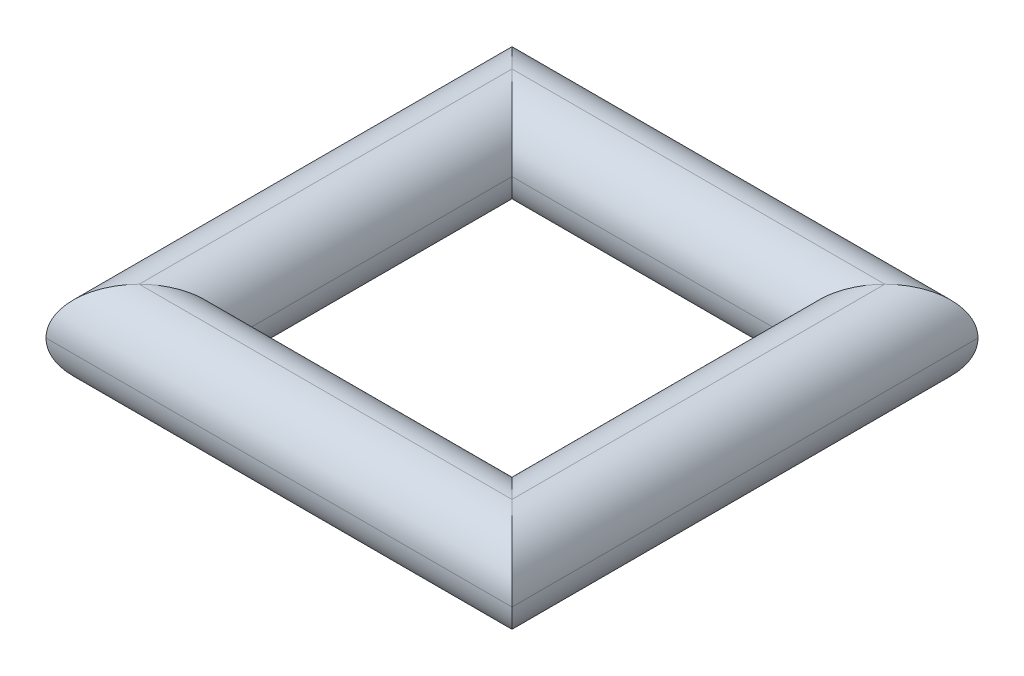
ISO-10303-21;
HEADER;
FILE_DESCRIPTION(('STEP AP214'),'2;1');
FILE_NAME('part.step','',(''),(''),'','','');
FILE_SCHEMA(('AUTOMOTIVE_DESIGN { 1 0 10303 214 1 1 1 1 }'));
ENDSEC;
DATA;
#1=APPLICATION_CONTEXT('core data for automotive mechanical design processes');
#2=APPLICATION_PROTOCOL_DEFINITION('international standard','automotive_design',2000,#1);
#3=PRODUCT_CONTEXT('',#1,'mechanical');
#4=PRODUCT('Part','Part','',(#3));
#5=PRODUCT_RELATED_PRODUCT_CATEGORY('part','',(#4));
#6=PRODUCT_DEFINITION_FORMATION('','',#4);
#7=PRODUCT_DEFINITION_CONTEXT('part definition',#1,'design');
#8=PRODUCT_DEFINITION('design','',#6,#7);
#9=PRODUCT_DEFINITION_SHAPE('','',#8);
#10=(LENGTH_UNIT() NAMED_UNIT(*) SI_UNIT(.MILLI.,.METRE.));
#11=(NAMED_UNIT(*) PLANE_ANGLE_UNIT() SI_UNIT($,.RADIAN.));
#12=(NAMED_UNIT(*) SI_UNIT($,.STERADIAN.) SOLID_ANGLE_UNIT());
#13=UNCERTAINTY_MEASURE_WITH_UNIT(LENGTH_MEASURE(1.E-05),#10,'distance_accuracy_value','');
#14=(GEOMETRIC_REPRESENTATION_CONTEXT(3) GLOBAL_UNCERTAINTY_ASSIGNED_CONTEXT((#13)) GLOBAL_UNIT_ASSIGNED_CONTEXT((#10,
#11,#12)) REPRESENTATION_CONTEXT('',''));
#15=CARTESIAN_POINT('',(0.,0.,0.));
#16=DIRECTION('',(0.,0.,1.));
#17=DIRECTION('',(1.,0.,0.));
#18=AXIS2_PLACEMENT_3D('',#15,#16,#17);
#19=CARTESIAN_POINT('',(-30.5188679245283,2.5,-20.4716981132076));
#20=DIRECTION('',(0.,0.,1.));
#21=DIRECTION('',(1.,0.,0.));
#22=AXIS2_PLACEMENT_3D('',#19,#20,#21);
#23=CYLINDRICAL_SURFACE('',#22,2.5);
#24=CARTESIAN_POINT('',(-30.5188679245283,2.5,-2.97169811320756));
#25=DIRECTION('',(0.707106781186548,0.,0.707106781186547));
#26=DIRECTION('',(-0.707106781186547,0.,0.707106781186548));
#27=AXIS2_PLACEMENT_3D('',#24,#25,#26);
#28=ELLIPSE('',#27,3.53553390593274,2.5);
#29=CARTESIAN_POINT('',(-28.0188679245283,2.5,-5.47169811320756));
#30=VERTEX_POINT('',#29);
#31=CARTESIAN_POINT('',(-30.5188679245283,5.,-2.97169811320756));
#32=VERTEX_POINT('',#31);
#33=EDGE_CURVE('E54',#30,#32,#28,.T.);
#34=ORIENTED_EDGE('',*,*,#33,.F.);
#35=DIRECTION('',(0.,0.,1.));
#36=VECTOR('',#35,1.);
#37=CARTESIAN_POINT('',(-28.0188679245283,2.5,-20.4716981132076));
#38=LINE('',#37,#36);
#39=CARTESIAN_POINT('',(-28.0188679245283,2.5,-20.4716981132076));
#40=VERTEX_POINT('',#39);
#41=EDGE_CURVE('E45',#40,#30,#38,.T.);
#42=ORIENTED_EDGE('',*,*,#41,.F.);
#43=CARTESIAN_POINT('',(-30.5188679245283,2.5,-22.9716981132076));
#44=DIRECTION('',(-0.707106781186547,0.,0.707106781186548));
#45=DIRECTION('',(-0.707106781186548,0.,-0.707106781186547));
#46=AXIS2_PLACEMENT_3D('',#43,#44,#45);
#47=ELLIPSE('',#46,3.53553390593274,2.5);
#48=CARTESIAN_POINT('',(-30.5188679245283,5.,-22.9716981132076));
#49=VERTEX_POINT('',#48);
#50=EDGE_CURVE('E167',#49,#40,#47,.F.);
#51=ORIENTED_EDGE('',*,*,#50,.F.);
#52=DIRECTION('',(0.,0.,1.));
#53=VECTOR('',#52,1.);
#54=CARTESIAN_POINT('',(-30.5188679245283,5.,0.));
#55=LINE('',#54,#53);
#56=EDGE_CURVE('E173',#32,#49,#55,.F.);
#57=ORIENTED_EDGE('',*,*,#56,.F.);
#58=EDGE_LOOP('',(#34,#42,#51,#57));
#59=FACE_BOUND('',#58,.T.);
#60=ADVANCED_FACE('F35',(#59),#23,.T.);
#61=CARTESIAN_POINT('',(-28.0188679245283,2.5,-22.9716981132076));
#62=DIRECTION('',(-1.,0.,0.));
#63=DIRECTION('',(0.,0.,1.));
#64=AXIS2_PLACEMENT_3D('',#61,#62,#63);
#65=CYLINDRICAL_SURFACE('',#64,2.5);
#66=ORIENTED_EDGE('',*,*,#50,.T.);
#67=DIRECTION('',(-1.,0.,0.));
#68=VECTOR('',#67,1.);
#69=CARTESIAN_POINT('',(-28.0188679245283,2.5,-20.4716981132076));
#70=LINE('',#69,#68);
#71=CARTESIAN_POINT('',(-13.0188679245283,2.5,-20.4716981132076));
#72=VERTEX_POINT('',#71);
#73=EDGE_CURVE('E180',#72,#40,#70,.T.);
#74=ORIENTED_EDGE('',*,*,#73,.F.);
#75=CARTESIAN_POINT('',(-10.5188679245283,2.5,-22.9716981132076));
#76=DIRECTION('',(-0.707106781186548,0.,-0.707106781186547));
#77=DIRECTION('',(0.707106781186547,0.,-0.707106781186548));
#78=AXIS2_PLACEMENT_3D('',#75,#76,#77);
#79=ELLIPSE('',#78,3.53553390593274,2.5);
#80=CARTESIAN_POINT('',(-10.5188679245283,5.,-22.9716981132076));
#81=VERTEX_POINT('',#80);
#82=EDGE_CURVE('E195',#81,#72,#79,.F.);
#83=ORIENTED_EDGE('',*,*,#82,.F.);
#84=DIRECTION('',(-1.,0.,0.));
#85=VECTOR('',#84,1.);
#86=CARTESIAN_POINT('',(0.,5.,-22.9716981132076));
#87=LINE('',#86,#85);
#88=EDGE_CURVE('E156',#49,#81,#87,.F.);
#89=ORIENTED_EDGE('',*,*,#88,.F.);
#90=EDGE_LOOP('',(#66,#74,#83,#89));
#91=FACE_BOUND('',#90,.T.);
#92=ADVANCED_FACE('F217',(#91),#65,.T.);
#93=CARTESIAN_POINT('',(-30.5188679245283,2.5,0.));
#94=DIRECTION('',(0.,0.,1.));
#95=DIRECTION('',(1.,0.,0.));
#96=AXIS2_PLACEMENT_3D('',#93,#94,#95);
#97=CYLINDRICAL_SURFACE('',#96,2.5);
#98=CARTESIAN_POINT('',(-30.5188679245283,2.5,-2.97169811320756));
#99=DIRECTION('',(0.707106781186547,0.,0.707106781186547));
#100=DIRECTION('',(-0.707106781186547,0.,0.707106781186547));
#101=AXIS2_PLACEMENT_3D('',#98,#99,#100);
#102=ELLIPSE('',#101,3.53553390593274,2.5);
#103=CARTESIAN_POINT('',(-33.0188679245283,2.5,-0.471698113207561));
#104=VERTEX_POINT('',#103);
#105=EDGE_CURVE('E189',#32,#104,#102,.T.);
#106=ORIENTED_EDGE('',*,*,#105,.F.);
#107=ORIENTED_EDGE('',*,*,#56,.T.);
#108=CARTESIAN_POINT('',(-30.5188679245283,2.5,-22.9716981132076));
#109=DIRECTION('',(-0.707106781186547,0.,0.707106781186547));
#110=DIRECTION('',(-0.707106781186547,0.,-0.707106781186547));
#111=AXIS2_PLACEMENT_3D('',#108,#109,#110);
#112=ELLIPSE('',#111,3.53553390593274,2.5);
#113=CARTESIAN_POINT('',(-33.0188679245283,2.5,-25.4716981132076));
#114=VERTEX_POINT('',#113);
#115=EDGE_CURVE('E192',#114,#49,#112,.F.);
#116=ORIENTED_EDGE('',*,*,#115,.F.);
#117=DIRECTION('',(0.,0.,1.));
#118=VECTOR('',#117,1.);
#119=CARTESIAN_POINT('',(-33.0188679245283,2.5,-25.4716981132076));
#120=LINE('',#119,#118);
#121=EDGE_CURVE('E170',#104,#114,#120,.F.);
#122=ORIENTED_EDGE('',*,*,#121,.F.);
#123=EDGE_LOOP('',(#106,#107,#116,#122));
#124=FACE_BOUND('',#123,.T.);
#125=ADVANCED_FACE('F220',(#124),#97,.T.);
#126=CARTESIAN_POINT('',(-28.0188679245283,2.5,-2.97169811320756));
#127=DIRECTION('',(1.,0.,0.));
#128=DIRECTION('',(0.,0.,-1.));
#129=AXIS2_PLACEMENT_3D('',#126,#127,#128);
#130=CYLINDRICAL_SURFACE('',#129,2.5);
#131=CARTESIAN_POINT('',(-10.5188679245283,2.5,-2.97169811320756));
#132=DIRECTION('',(0.707106781186547,0.,-0.707106781186548));
#133=DIRECTION('',(-0.707106781186548,0.,-0.707106781186547));
#134=AXIS2_PLACEMENT_3D('',#131,#132,#133);
#135=ELLIPSE('',#134,3.53553390593274,2.5);
#136=CARTESIAN_POINT('',(-13.0188679245283,2.5,-5.47169811320756));
#137=VERTEX_POINT('',#136);
#138=CARTESIAN_POINT('',(-10.5188679245283,5.,-2.97169811320756));
#139=VERTEX_POINT('',#138);
#140=EDGE_CURVE('E135',#137,#139,#135,.T.);
#141=ORIENTED_EDGE('',*,*,#140,.F.);
#142=DIRECTION('',(1.,0.,0.));
#143=VECTOR('',#142,1.);
#144=CARTESIAN_POINT('',(-28.0188679245283,2.5,-5.47169811320756));
#145=LINE('',#144,#143);
#146=EDGE_CURVE('E12',#30,#137,#145,.T.);
#147=ORIENTED_EDGE('',*,*,#146,.F.);
#148=ORIENTED_EDGE('',*,*,#33,.T.);
#149=DIRECTION('',(1.,0.,0.));
#150=VECTOR('',#149,1.);
#151=CARTESIAN_POINT('',(0.,5.,-2.97169811320756));
#152=LINE('',#151,#150);
#153=EDGE_CURVE('E186',#139,#32,#152,.F.);
#154=ORIENTED_EDGE('',*,*,#153,.F.);
#155=EDGE_LOOP('',(#141,#147,#148,#154));
#156=FACE_BOUND('',#155,.T.);
#157=ADVANCED_FACE('F221',(#156),#130,.T.);
#158=CARTESIAN_POINT('',(-10.5188679245283,2.5,-20.4716981132076));
#159=DIRECTION('',(0.,0.,-1.));
#160=DIRECTION('',(-1.,0.,0.));
#161=AXIS2_PLACEMENT_3D('',#158,#159,#160);
#162=CYLINDRICAL_SURFACE('',#161,2.5);
#163=DIRECTION('',(0.,0.,-1.));
#164=VECTOR('',#163,1.);
#165=CARTESIAN_POINT('',(-13.0188679245283,2.5,-20.4716981132076));
#166=LINE('',#165,#164);
#167=EDGE_CURVE('E89',#137,#72,#166,.T.);
#168=ORIENTED_EDGE('',*,*,#167,.F.);
#169=ORIENTED_EDGE('',*,*,#140,.T.);
#170=DIRECTION('',(0.,0.,-1.));
#171=VECTOR('',#170,1.);
#172=CARTESIAN_POINT('',(-10.5188679245283,5.,0.));
#173=LINE('',#172,#171);
#174=EDGE_CURVE('E160',#81,#139,#173,.F.);
#175=ORIENTED_EDGE('',*,*,#174,.F.);
#176=ORIENTED_EDGE('',*,*,#82,.T.);
#177=EDGE_LOOP('',(#168,#169,#175,#176));
#178=FACE_BOUND('',#177,.T.);
#179=ADVANCED_FACE('F232',(#178),#162,.T.);
#180=CARTESIAN_POINT('',(-33.0188679245283,2.5,-22.9716981132076));
#181=DIRECTION('',(-1.,0.,0.));
#182=DIRECTION('',(0.,0.,1.));
#183=AXIS2_PLACEMENT_3D('',#180,#181,#182);
#184=CYLINDRICAL_SURFACE('',#183,2.5);
#185=ORIENTED_EDGE('',*,*,#115,.T.);
#186=ORIENTED_EDGE('',*,*,#88,.T.);
#187=CARTESIAN_POINT('',(-10.5188679245283,2.5,-22.9716981132076));
#188=DIRECTION('',(-0.707106781186548,0.,-0.707106781186547));
#189=DIRECTION('',(-0.707106781186547,0.,0.707106781186548));
#190=AXIS2_PLACEMENT_3D('',#187,#188,#189);
#191=ELLIPSE('',#190,3.53553390593274,2.5);
#192=CARTESIAN_POINT('',(-8.01886792452833,2.5,-25.4716981132076));
#193=VERTEX_POINT('',#192);
#194=EDGE_CURVE('E151',#193,#81,#191,.F.);
#195=ORIENTED_EDGE('',*,*,#194,.F.);
#196=DIRECTION('',(1.,0.,0.));
#197=VECTOR('',#196,1.);
#198=CARTESIAN_POINT('',(-8.01886792452833,2.5,-25.4716981132076));
#199=LINE('',#198,#197);
#200=EDGE_CURVE('E118',#114,#193,#199,.T.);
#201=ORIENTED_EDGE('',*,*,#200,.F.);
#202=EDGE_LOOP('',(#185,#186,#195,#201));
#203=FACE_BOUND('',#202,.T.);
#204=ADVANCED_FACE('F154',(#203),#184,.T.);
#205=CARTESIAN_POINT('',(0.,2.5,-2.97169811320756));
#206=DIRECTION('',(1.,0.,0.));
#207=DIRECTION('',(0.,0.,-1.));
#208=AXIS2_PLACEMENT_3D('',#205,#206,#207);
#209=CYLINDRICAL_SURFACE('',#208,2.5);
#210=ORIENTED_EDGE('',*,*,#105,.T.);
#211=DIRECTION('',(1.,0.,0.));
#212=VECTOR('',#211,1.);
#213=CARTESIAN_POINT('',(-33.0188679245283,2.5,-0.471698113207561));
#214=LINE('',#213,#212);
#215=CARTESIAN_POINT('',(-8.01886792452833,2.5,-0.471698113207561));
#216=VERTEX_POINT('',#215);
#217=EDGE_CURVE('E166',#216,#104,#214,.F.);
#218=ORIENTED_EDGE('',*,*,#217,.F.);
#219=CARTESIAN_POINT('',(-10.5188679245283,2.5,-2.97169811320756));
#220=DIRECTION('',(0.707106781186547,0.,-0.707106781186548));
#221=DIRECTION('',(0.707106781186548,0.,0.707106781186547));
#222=AXIS2_PLACEMENT_3D('',#219,#220,#221);
#223=ELLIPSE('',#222,3.53553390593274,2.5);
#224=EDGE_CURVE('E94',#139,#216,#223,.T.);
#225=ORIENTED_EDGE('',*,*,#224,.F.);
#226=ORIENTED_EDGE('',*,*,#153,.T.);
#227=EDGE_LOOP('',(#210,#218,#225,#226));
#228=FACE_BOUND('',#227,.T.);
#229=ADVANCED_FACE('F224',(#228),#209,.T.);
#230=CARTESIAN_POINT('',(-10.5188679245283,2.5,-25.4716981132076));
#231=DIRECTION('',(0.,0.,-1.));
#232=DIRECTION('',(-1.,0.,0.));
#233=AXIS2_PLACEMENT_3D('',#230,#231,#232);
#234=CYLINDRICAL_SURFACE('',#233,2.5);
#235=ORIENTED_EDGE('',*,*,#194,.T.);
#236=ORIENTED_EDGE('',*,*,#174,.T.);
#237=ORIENTED_EDGE('',*,*,#224,.T.);
#238=DIRECTION('',(0.,0.,1.));
#239=VECTOR('',#238,1.);
#240=CARTESIAN_POINT('',(-8.01886792452833,2.5,-0.471698113207561));
#241=LINE('',#240,#239);
#242=EDGE_CURVE('E162',#193,#216,#241,.T.);
#243=ORIENTED_EDGE('',*,*,#242,.F.);
#244=EDGE_LOOP('',(#235,#236,#237,#243));
#245=FACE_BOUND('',#244,.T.);
#246=ADVANCED_FACE('F163',(#245),#234,.T.);
#247=CARTESIAN_POINT('',(-10.5188679245283,2.5,0.));
#248=DIRECTION('',(0.,0.,1.));
#249=DIRECTION('',(1.,0.,0.));
#250=AXIS2_PLACEMENT_3D('',#247,#248,#249);
#251=CYLINDRICAL_SURFACE('',#250,2.5);
#252=CARTESIAN_POINT('',(-10.5188679245283,2.5,-2.97169811320756));
#253=DIRECTION('',(-0.707106781186547,0.,0.707106781186548));
#254=DIRECTION('',(0.707106781186548,0.,0.707106781186547));
#255=AXIS2_PLACEMENT_3D('',#252,#253,#254);
#256=ELLIPSE('',#255,3.53553390593274,2.5);
#257=CARTESIAN_POINT('',(-10.5188679245283,0.,-2.97169811320756));
#258=VERTEX_POINT('',#257);
#259=EDGE_CURVE('E106',#137,#258,#256,.T.);
#260=ORIENTED_EDGE('',*,*,#259,.F.);
#261=ORIENTED_EDGE('',*,*,#167,.T.);
#262=CARTESIAN_POINT('',(-10.5188679245283,2.5,-22.9716981132076));
#263=DIRECTION('',(0.707106781186548,0.,0.707106781186547));
#264=DIRECTION('',(0.707106781186547,0.,-0.707106781186548));
#265=AXIS2_PLACEMENT_3D('',#262,#263,#264);
#266=ELLIPSE('',#265,3.53553390593274,2.5);
#267=CARTESIAN_POINT('',(-10.5188679245283,0.,-22.9716981132076));
#268=VERTEX_POINT('',#267);
#269=EDGE_CURVE('E39',#268,#72,#266,.F.);
#270=ORIENTED_EDGE('',*,*,#269,.F.);
#271=DIRECTION('',(0.,0.,-1.));
#272=VECTOR('',#271,1.);
#273=CARTESIAN_POINT('',(-10.5188679245283,0.,-20.4716981132076));
#274=LINE('',#273,#272);
#275=EDGE_CURVE('E83',#258,#268,#274,.T.);
#276=ORIENTED_EDGE('',*,*,#275,.F.);
#277=EDGE_LOOP('',(#260,#261,#270,#276));
#278=FACE_BOUND('',#277,.T.);
#279=ADVANCED_FACE('F37',(#278),#251,.T.);
#280=CARTESIAN_POINT('',(0.,2.5,-22.9716981132076));
#281=DIRECTION('',(1.,0.,0.));
#282=DIRECTION('',(0.,0.,-1.));
#283=AXIS2_PLACEMENT_3D('',#280,#281,#282);
#284=CYLINDRICAL_SURFACE('',#283,2.5);
#285=ORIENTED_EDGE('',*,*,#269,.T.);
#286=ORIENTED_EDGE('',*,*,#73,.T.);
#287=CARTESIAN_POINT('',(-30.5188679245283,2.5,-22.9716981132076));
#288=DIRECTION('',(0.707106781186547,0.,-0.707106781186548));
#289=DIRECTION('',(0.707106781186548,0.,0.707106781186547));
#290=AXIS2_PLACEMENT_3D('',#287,#288,#289);
#291=ELLIPSE('',#290,3.53553390593274,2.5);
#292=CARTESIAN_POINT('',(-30.5188679245283,0.,-22.9716981132076));
#293=VERTEX_POINT('',#292);
#294=EDGE_CURVE('E111',#293,#40,#291,.F.);
#295=ORIENTED_EDGE('',*,*,#294,.F.);
#296=DIRECTION('',(-1.,0.,0.));
#297=VECTOR('',#296,1.);
#298=CARTESIAN_POINT('',(-28.0188679245283,0.,-22.9716981132076));
#299=LINE('',#298,#297);
#300=EDGE_CURVE('E108',#268,#293,#299,.T.);
#301=ORIENTED_EDGE('',*,*,#300,.F.);
#302=EDGE_LOOP('',(#285,#286,#295,#301));
#303=FACE_BOUND('',#302,.T.);
#304=ADVANCED_FACE('F109',(#303),#284,.T.);
#305=CARTESIAN_POINT('',(-10.5188679245283,2.5,0.));
#306=DIRECTION('',(0.,0.,1.));
#307=DIRECTION('',(1.,0.,0.));
#308=AXIS2_PLACEMENT_3D('',#305,#306,#307);
#309=CYLINDRICAL_SURFACE('',#308,2.5);
#310=CARTESIAN_POINT('',(-10.5188679245283,2.5,-2.97169811320756));
#311=DIRECTION('',(-0.707106781186547,0.,0.707106781186548));
#312=DIRECTION('',(0.707106781186548,0.,0.707106781186547));
#313=AXIS2_PLACEMENT_3D('',#310,#311,#312);
#314=ELLIPSE('',#313,3.53553390593274,2.5);
#315=EDGE_CURVE('E104',#258,#216,#314,.T.);
#316=ORIENTED_EDGE('',*,*,#315,.F.);
#317=ORIENTED_EDGE('',*,*,#275,.T.);
#318=CARTESIAN_POINT('',(-10.5188679245283,2.5,-22.9716981132076));
#319=DIRECTION('',(0.707106781186548,0.,0.707106781186547));
#320=DIRECTION('',(0.707106781186547,0.,-0.707106781186548));
#321=AXIS2_PLACEMENT_3D('',#318,#319,#320);
#322=ELLIPSE('',#321,3.53553390593274,2.5);
#323=EDGE_CURVE('E101',#193,#268,#322,.F.);
#324=ORIENTED_EDGE('',*,*,#323,.F.);
#325=ORIENTED_EDGE('',*,*,#242,.T.);
#326=EDGE_LOOP('',(#316,#317,#324,#325));
#327=FACE_BOUND('',#326,.T.);
#328=ADVANCED_FACE('F98',(#327),#309,.T.);
#329=CARTESIAN_POINT('',(0.,2.5,-2.97169811320756));
#330=DIRECTION('',(-1.,0.,0.));
#331=DIRECTION('',(0.,0.,1.));
#332=AXIS2_PLACEMENT_3D('',#329,#330,#331);
#333=CYLINDRICAL_SURFACE('',#332,2.5);
#334=CARTESIAN_POINT('',(-30.5188679245283,2.5,-2.97169811320756));
#335=DIRECTION('',(-0.707106781186548,0.,-0.707106781186547));
#336=DIRECTION('',(-0.707106781186547,0.,0.707106781186548));
#337=AXIS2_PLACEMENT_3D('',#334,#335,#336);
#338=ELLIPSE('',#337,3.53553390593274,2.5);
#339=CARTESIAN_POINT('',(-30.5188679245283,0.,-2.97169811320756));
#340=VERTEX_POINT('',#339);
#341=EDGE_CURVE('E125',#30,#340,#338,.T.);
#342=ORIENTED_EDGE('',*,*,#341,.F.);
#343=ORIENTED_EDGE('',*,*,#146,.T.);
#344=ORIENTED_EDGE('',*,*,#259,.T.);
#345=DIRECTION('',(1.,0.,0.));
#346=VECTOR('',#345,1.);
#347=CARTESIAN_POINT('',(-13.0188679245283,0.,-2.97169811320756));
#348=LINE('',#347,#346);
#349=EDGE_CURVE('E120',#340,#258,#348,.T.);
#350=ORIENTED_EDGE('',*,*,#349,.F.);
#351=EDGE_LOOP('',(#342,#343,#344,#350));
#352=FACE_BOUND('',#351,.T.);
#353=ADVANCED_FACE('F130',(#352),#333,.T.);
#354=CARTESIAN_POINT('',(-30.5188679245283,2.5,0.));
#355=DIRECTION('',(0.,0.,-1.));
#356=DIRECTION('',(-1.,0.,0.));
#357=AXIS2_PLACEMENT_3D('',#354,#355,#356);
#358=CYLINDRICAL_SURFACE('',#357,2.5);
#359=ORIENTED_EDGE('',*,*,#41,.T.);
#360=ORIENTED_EDGE('',*,*,#341,.T.);
#361=DIRECTION('',(0.,0.,1.));
#362=VECTOR('',#361,1.);
#363=CARTESIAN_POINT('',(-30.5188679245283,0.,-5.47169811320756));
#364=LINE('',#363,#362);
#365=EDGE_CURVE('E206',#293,#340,#364,.T.);
#366=ORIENTED_EDGE('',*,*,#365,.F.);
#367=ORIENTED_EDGE('',*,*,#294,.T.);
#368=EDGE_LOOP('',(#359,#360,#366,#367));
#369=FACE_BOUND('',#368,.T.);
#370=ADVANCED_FACE('F214',(#369),#358,.T.);
#371=CARTESIAN_POINT('',(0.,2.5,-22.9716981132076));
#372=DIRECTION('',(1.,0.,0.));
#373=DIRECTION('',(0.,0.,-1.));
#374=AXIS2_PLACEMENT_3D('',#371,#372,#373);
#375=CYLINDRICAL_SURFACE('',#374,2.5);
#376=ORIENTED_EDGE('',*,*,#323,.T.);
#377=ORIENTED_EDGE('',*,*,#300,.T.);
#378=CARTESIAN_POINT('',(-30.5188679245283,2.5,-22.9716981132076));
#379=DIRECTION('',(0.707106781186547,0.,-0.707106781186547));
#380=DIRECTION('',(0.707106781186547,0.,0.707106781186547));
#381=AXIS2_PLACEMENT_3D('',#378,#379,#380);
#382=ELLIPSE('',#381,3.53553390593274,2.5);
#383=EDGE_CURVE('E203',#114,#293,#382,.F.);
#384=ORIENTED_EDGE('',*,*,#383,.F.);
#385=ORIENTED_EDGE('',*,*,#200,.T.);
#386=EDGE_LOOP('',(#376,#377,#384,#385));
#387=FACE_BOUND('',#386,.T.);
#388=ADVANCED_FACE('F116',(#387),#375,.T.);
#389=CARTESIAN_POINT('',(-33.0188679245283,2.5,-2.97169811320756));
#390=DIRECTION('',(-1.,0.,0.));
#391=DIRECTION('',(0.,0.,1.));
#392=AXIS2_PLACEMENT_3D('',#389,#390,#391);
#393=CYLINDRICAL_SURFACE('',#392,2.5);
#394=ORIENTED_EDGE('',*,*,#315,.T.);
#395=ORIENTED_EDGE('',*,*,#217,.T.);
#396=CARTESIAN_POINT('',(-30.5188679245283,2.5,-2.97169811320756));
#397=DIRECTION('',(-0.707106781186547,0.,-0.707106781186547));
#398=DIRECTION('',(-0.707106781186547,0.,0.707106781186547));
#399=AXIS2_PLACEMENT_3D('',#396,#397,#398);
#400=ELLIPSE('',#399,3.53553390593274,2.5);
#401=EDGE_CURVE('E201',#340,#104,#400,.T.);
#402=ORIENTED_EDGE('',*,*,#401,.F.);
#403=ORIENTED_EDGE('',*,*,#349,.T.);
#404=EDGE_LOOP('',(#394,#395,#402,#403));
#405=FACE_BOUND('',#404,.T.);
#406=ADVANCED_FACE('F209',(#405),#393,.T.);
#407=CARTESIAN_POINT('',(-30.5188679245283,2.5,-25.4716981132076));
#408=DIRECTION('',(0.,0.,-1.));
#409=DIRECTION('',(-1.,0.,0.));
#410=AXIS2_PLACEMENT_3D('',#407,#408,#409);
#411=CYLINDRICAL_SURFACE('',#410,2.5);
#412=ORIENTED_EDGE('',*,*,#383,.T.);
#413=ORIENTED_EDGE('',*,*,#365,.T.);
#414=ORIENTED_EDGE('',*,*,#401,.T.);
#415=ORIENTED_EDGE('',*,*,#121,.T.);
#416=EDGE_LOOP('',(#412,#413,#414,#415));
#417=FACE_BOUND('',#416,.T.);
#418=ADVANCED_FACE('F212',(#417),#411,.T.);
#419=CLOSED_SHELL('',(#60,#92,#125,#157,#179,#204,#229,#246,#279,#304,#328,#353,#370,#388,#406,#418));
#420=MANIFOLD_SOLID_BREP('B2',#419);
#421=ADVANCED_BREP_SHAPE_REPRESENTATION('',(#18,#420),#14);
#422=SHAPE_DEFINITION_REPRESENTATION(#9,#421);
ENDSEC;
END-ISO-10303-21;
